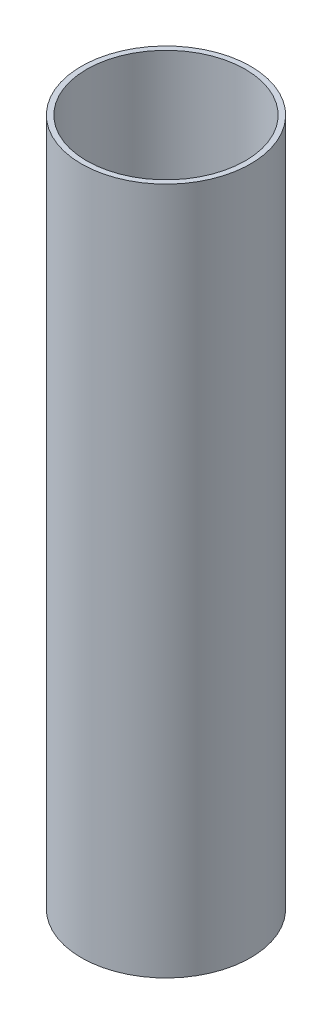
ISO-10303-21;
HEADER;
FILE_DESCRIPTION(('STEP AP214'),'2;1');
FILE_NAME('part.step','',(''),(''),'','','');
FILE_SCHEMA(('AUTOMOTIVE_DESIGN { 1 0 10303 214 1 1 1 1 }'));
ENDSEC;
DATA;
#1=APPLICATION_CONTEXT('core data for automotive mechanical design processes');
#2=APPLICATION_PROTOCOL_DEFINITION('international standard','automotive_design',2000,#1);
#3=PRODUCT_CONTEXT('',#1,'mechanical');
#4=PRODUCT('Part','Part','',(#3));
#5=PRODUCT_RELATED_PRODUCT_CATEGORY('part','',(#4));
#6=PRODUCT_DEFINITION_FORMATION('','',#4);
#7=PRODUCT_DEFINITION_CONTEXT('part definition',#1,'design');
#8=PRODUCT_DEFINITION('design','',#6,#7);
#9=PRODUCT_DEFINITION_SHAPE('','',#8);
#10=(LENGTH_UNIT() NAMED_UNIT(*) SI_UNIT(.MILLI.,.METRE.));
#11=(NAMED_UNIT(*) PLANE_ANGLE_UNIT() SI_UNIT($,.RADIAN.));
#12=(NAMED_UNIT(*) SI_UNIT($,.STERADIAN.) SOLID_ANGLE_UNIT());
#13=UNCERTAINTY_MEASURE_WITH_UNIT(LENGTH_MEASURE(1.E-05),#10,'distance_accuracy_value','');
#14=(GEOMETRIC_REPRESENTATION_CONTEXT(3) GLOBAL_UNCERTAINTY_ASSIGNED_CONTEXT((#13)) GLOBAL_UNIT_ASSIGNED_CONTEXT((#10,
#11,#12)) REPRESENTATION_CONTEXT('',''));
#15=CARTESIAN_POINT('',(0.,0.,0.));
#16=DIRECTION('',(0.,0.,1.));
#17=DIRECTION('',(1.,0.,0.));
#18=AXIS2_PLACEMENT_3D('',#15,#16,#17);
#19=CARTESIAN_POINT('',(0.,130.,0.));
#20=DIRECTION('',(0.,1.,0.));
#21=DIRECTION('',(0.,0.,1.));
#22=AXIS2_PLACEMENT_3D('',#19,#20,#21);
#23=PLANE('',#22);
#24=CARTESIAN_POINT('',(0.,130.,0.));
#25=DIRECTION('',(0.,1.,0.));
#26=DIRECTION('',(0.,0.,1.));
#27=AXIS2_PLACEMENT_3D('',#24,#25,#26);
#28=CIRCLE('',#27,16.);
#29=CARTESIAN_POINT('',(0.,130.,16.));
#30=VERTEX_POINT('',#29);
#31=EDGE_CURVE('E11',#30,#30,#28,.T.);
#32=ORIENTED_EDGE('',*,*,#31,.T.);
#33=EDGE_LOOP('',(#32));
#34=FACE_BOUND('',#33,.T.);
#35=CARTESIAN_POINT('',(0.,130.,0.));
#36=DIRECTION('',(0.,1.,0.));
#37=DIRECTION('',(0.,0.,1.));
#38=AXIS2_PLACEMENT_3D('',#35,#36,#37);
#39=CIRCLE('',#38,15.);
#40=CARTESIAN_POINT('',(0.,130.,15.));
#41=VERTEX_POINT('',#40);
#42=EDGE_CURVE('E48',#41,#41,#39,.T.);
#43=ORIENTED_EDGE('',*,*,#42,.F.);
#44=EDGE_LOOP('',(#43));
#45=FACE_BOUND('',#44,.T.);
#46=ADVANCED_FACE('F37',(#34,#45),#23,.T.);
#47=CARTESIAN_POINT('',(0.,0.,0.));
#48=DIRECTION('',(0.,1.,0.));
#49=DIRECTION('',(0.,0.,1.));
#50=AXIS2_PLACEMENT_3D('',#47,#48,#49);
#51=PLANE('',#50);
#52=CARTESIAN_POINT('',(0.,0.,0.));
#53=DIRECTION('',(0.,1.,0.));
#54=DIRECTION('',(0.,0.,1.));
#55=AXIS2_PLACEMENT_3D('',#52,#53,#54);
#56=CIRCLE('',#55,16.);
#57=CARTESIAN_POINT('',(0.,0.,16.));
#58=VERTEX_POINT('',#57);
#59=EDGE_CURVE('E41',#58,#58,#56,.T.);
#60=ORIENTED_EDGE('',*,*,#59,.F.);
#61=EDGE_LOOP('',(#60));
#62=FACE_BOUND('',#61,.T.);
#63=CARTESIAN_POINT('',(0.,0.,0.));
#64=DIRECTION('',(0.,1.,0.));
#65=DIRECTION('',(0.,0.,1.));
#66=AXIS2_PLACEMENT_3D('',#63,#64,#65);
#67=CIRCLE('',#66,15.);
#68=CARTESIAN_POINT('',(0.,0.,15.));
#69=VERTEX_POINT('',#68);
#70=EDGE_CURVE('E50',#69,#69,#67,.T.);
#71=ORIENTED_EDGE('',*,*,#70,.T.);
#72=EDGE_LOOP('',(#71));
#73=FACE_BOUND('',#72,.T.);
#74=ADVANCED_FACE('F60',(#62,#73),#51,.F.);
#75=CARTESIAN_POINT('',(0.,130.,0.));
#76=DIRECTION('',(0.,-1.,0.));
#77=DIRECTION('',(0.,0.,-1.));
#78=AXIS2_PLACEMENT_3D('',#75,#76,#77);
#79=CYLINDRICAL_SURFACE('',#78,16.);
#80=ORIENTED_EDGE('',*,*,#31,.F.);
#81=EDGE_LOOP('',(#80));
#82=FACE_BOUND('',#81,.T.);
#83=ORIENTED_EDGE('',*,*,#59,.T.);
#84=EDGE_LOOP('',(#83));
#85=FACE_BOUND('',#84,.T.);
#86=ADVANCED_FACE('F39',(#82,#85),#79,.T.);
#87=CARTESIAN_POINT('',(0.,130.,0.));
#88=DIRECTION('',(0.,-1.,0.));
#89=DIRECTION('',(0.,0.,-1.));
#90=AXIS2_PLACEMENT_3D('',#87,#88,#89);
#91=CYLINDRICAL_SURFACE('',#90,15.);
#92=ORIENTED_EDGE('',*,*,#42,.T.);
#93=EDGE_LOOP('',(#92));
#94=FACE_BOUND('',#93,.T.);
#95=ORIENTED_EDGE('',*,*,#70,.F.);
#96=EDGE_LOOP('',(#95));
#97=FACE_BOUND('',#96,.T.);
#98=ADVANCED_FACE('F56',(#94,#97),#91,.F.);
#99=CLOSED_SHELL('',(#46,#74,#86,#98));
#100=MANIFOLD_SOLID_BREP('B2',#99);
#101=ADVANCED_BREP_SHAPE_REPRESENTATION('',(#18,#100),#14);
#102=SHAPE_DEFINITION_REPRESENTATION(#9,#101);
ENDSEC;
END-ISO-10303-21;
